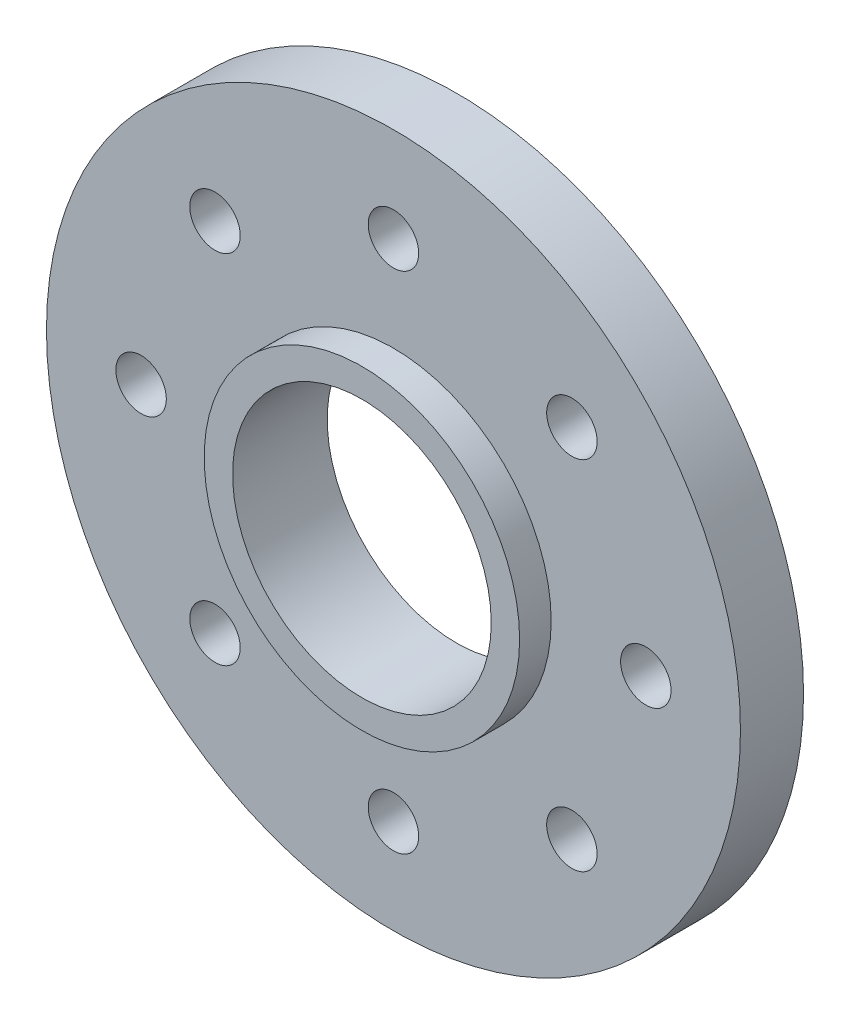
ISO-10303-21;
HEADER;
FILE_DESCRIPTION(('STEP AP214'),'2;1');
FILE_NAME('part.step','',(''),(''),'','','');
FILE_SCHEMA(('AUTOMOTIVE_DESIGN { 1 0 10303 214 1 1 1 1 }'));
ENDSEC;
DATA;
#1=APPLICATION_CONTEXT('core data for automotive mechanical design processes');
#2=APPLICATION_PROTOCOL_DEFINITION('international standard','automotive_design',2000,#1);
#3=PRODUCT_CONTEXT('',#1,'mechanical');
#4=PRODUCT('Part','Part','',(#3));
#5=PRODUCT_RELATED_PRODUCT_CATEGORY('part','',(#4));
#6=PRODUCT_DEFINITION_FORMATION('','',#4);
#7=PRODUCT_DEFINITION_CONTEXT('part definition',#1,'design');
#8=PRODUCT_DEFINITION('design','',#6,#7);
#9=PRODUCT_DEFINITION_SHAPE('','',#8);
#10=(LENGTH_UNIT() NAMED_UNIT(*) SI_UNIT(.MILLI.,.METRE.));
#11=(NAMED_UNIT(*) PLANE_ANGLE_UNIT() SI_UNIT($,.RADIAN.));
#12=(NAMED_UNIT(*) SI_UNIT($,.STERADIAN.) SOLID_ANGLE_UNIT());
#13=UNCERTAINTY_MEASURE_WITH_UNIT(LENGTH_MEASURE(1.E-05),#10,'distance_accuracy_value','');
#14=(GEOMETRIC_REPRESENTATION_CONTEXT(3) GLOBAL_UNCERTAINTY_ASSIGNED_CONTEXT((#13)) GLOBAL_UNIT_ASSIGNED_CONTEXT((#10,
#11,#12)) REPRESENTATION_CONTEXT('',''));
#15=CARTESIAN_POINT('',(0.,0.,0.));
#16=DIRECTION('',(0.,0.,1.));
#17=DIRECTION('',(1.,0.,0.));
#18=AXIS2_PLACEMENT_3D('',#15,#16,#17);
#19=CARTESIAN_POINT('',(0.,0.,2.));
#20=DIRECTION('',(0.,0.,1.));
#21=DIRECTION('',(1.,0.,0.));
#22=AXIS2_PLACEMENT_3D('',#19,#20,#21);
#23=PLANE('',#22);
#24=CARTESIAN_POINT('',(0.,0.,2.));
#25=DIRECTION('',(0.,0.,1.));
#26=DIRECTION('',(1.,0.,0.));
#27=AXIS2_PLACEMENT_3D('',#24,#25,#26);
#28=CIRCLE('',#27,11.);
#29=CARTESIAN_POINT('',(11.,0.,2.));
#30=VERTEX_POINT('',#29);
#31=EDGE_CURVE('E10',#30,#30,#28,.T.);
#32=ORIENTED_EDGE('',*,*,#31,.T.);
#33=EDGE_LOOP('',(#32));
#34=FACE_BOUND('',#33,.T.);
#35=CARTESIAN_POINT('',(-5.65685424949231,5.65685424949245,2.));
#36=DIRECTION('',(0.,0.,1.));
#37=DIRECTION('',(1.,0.,0.));
#38=AXIS2_PLACEMENT_3D('',#35,#36,#37);
#39=CIRCLE('',#38,0.79999999999999);
#40=CARTESIAN_POINT('',(-4.85685424949232,5.65685424949245,2.));
#41=VERTEX_POINT('',#40);
#42=EDGE_CURVE('E75',#41,#41,#39,.T.);
#43=ORIENTED_EDGE('',*,*,#42,.F.);
#44=EDGE_LOOP('',(#43));
#45=FACE_BOUND('',#44,.T.);
#46=CARTESIAN_POINT('',(-7.99999999999989,-1.1350726290868E-13,2.));
#47=DIRECTION('',(0.,0.,1.));
#48=DIRECTION('',(1.,0.,0.));
#49=AXIS2_PLACEMENT_3D('',#46,#47,#48);
#50=CIRCLE('',#49,0.79999999999999);
#51=CARTESIAN_POINT('',(-7.1999999999999,-1.1350726290868E-13,2.));
#52=VERTEX_POINT('',#51);
#53=EDGE_CURVE('E80',#52,#52,#50,.T.);
#54=ORIENTED_EDGE('',*,*,#53,.F.);
#55=EDGE_LOOP('',(#54));
#56=FACE_BOUND('',#55,.T.);
#57=CARTESIAN_POINT('',(-5.65685424949219,-5.65685424949246,2.));
#58=DIRECTION('',(0.,0.,1.));
#59=DIRECTION('',(1.,0.,0.));
#60=AXIS2_PLACEMENT_3D('',#57,#58,#59);
#61=CIRCLE('',#60,0.79999999999999);
#62=CARTESIAN_POINT('',(-4.8568542494922,-5.65685424949246,2.));
#63=VERTEX_POINT('',#62);
#64=EDGE_CURVE('E123',#63,#63,#61,.T.);
#65=ORIENTED_EDGE('',*,*,#64,.F.);
#66=EDGE_LOOP('',(#65));
#67=FACE_BOUND('',#66,.T.);
#68=CARTESIAN_POINT('',(2.25521545591289E-13,-8.,2.));
#69=DIRECTION('',(0.,0.,1.));
#70=DIRECTION('',(1.,0.,0.));
#71=AXIS2_PLACEMENT_3D('',#68,#69,#70);
#72=CIRCLE('',#71,0.79999999999999);
#73=CARTESIAN_POINT('',(0.800000000000215,-8.,2.));
#74=VERTEX_POINT('',#73);
#75=EDGE_CURVE('E116',#74,#74,#72,.T.);
#76=ORIENTED_EDGE('',*,*,#75,.F.);
#77=EDGE_LOOP('',(#76));
#78=FACE_BOUND('',#77,.T.);
#79=CARTESIAN_POINT('',(5.65685424949257,-5.6568542494923,2.));
#80=DIRECTION('',(0.,0.,1.));
#81=DIRECTION('',(1.,0.,0.));
#82=AXIS2_PLACEMENT_3D('',#79,#80,#81);
#83=CIRCLE('',#82,0.79999999999999);
#84=CARTESIAN_POINT('',(6.45685424949256,-5.6568542494923,2.));
#85=VERTEX_POINT('',#84);
#86=EDGE_CURVE('E84',#85,#85,#83,.T.);
#87=ORIENTED_EDGE('',*,*,#86,.F.);
#88=EDGE_LOOP('',(#87));
#89=FACE_BOUND('',#88,.T.);
#90=CARTESIAN_POINT('',(8.,0.,2.));
#91=DIRECTION('',(0.,0.,1.));
#92=DIRECTION('',(1.,0.,0.));
#93=AXIS2_PLACEMENT_3D('',#90,#91,#92);
#94=CIRCLE('',#93,0.79999999999999);
#95=CARTESIAN_POINT('',(8.79999999999999,0.,2.));
#96=VERTEX_POINT('',#95);
#97=EDGE_CURVE('E85',#96,#96,#94,.T.);
#98=ORIENTED_EDGE('',*,*,#97,.F.);
#99=EDGE_LOOP('',(#98));
#100=FACE_BOUND('',#99,.T.);
#101=CARTESIAN_POINT('',(5.65685424949239,5.65685424949237,2.));
#102=DIRECTION('',(0.,0.,1.));
#103=DIRECTION('',(1.,0.,0.));
#104=AXIS2_PLACEMENT_3D('',#101,#102,#103);
#105=CIRCLE('',#104,0.79999999999999);
#106=CARTESIAN_POINT('',(6.45685424949238,5.65685424949237,2.));
#107=VERTEX_POINT('',#106);
#108=EDGE_CURVE('E89',#107,#107,#105,.T.);
#109=ORIENTED_EDGE('',*,*,#108,.F.);
#110=EDGE_LOOP('',(#109));
#111=FACE_BOUND('',#110,.T.);
#112=CARTESIAN_POINT('',(0.,8.,2.));
#113=DIRECTION('',(0.,0.,1.));
#114=DIRECTION('',(1.,0.,0.));
#115=AXIS2_PLACEMENT_3D('',#112,#113,#114);
#116=CIRCLE('',#115,0.79999999999999);
#117=CARTESIAN_POINT('',(0.79999999999999,8.,2.));
#118=VERTEX_POINT('',#117);
#119=EDGE_CURVE('E106',#118,#118,#116,.T.);
#120=ORIENTED_EDGE('',*,*,#119,.F.);
#121=EDGE_LOOP('',(#120));
#122=FACE_BOUND('',#121,.T.);
#123=CARTESIAN_POINT('',(0.,0.,2.));
#124=DIRECTION('',(0.,0.,1.));
#125=DIRECTION('',(1.,0.,0.));
#126=AXIS2_PLACEMENT_3D('',#123,#124,#125);
#127=CIRCLE('',#126,5.);
#128=CARTESIAN_POINT('',(5.,0.,2.));
#129=VERTEX_POINT('',#128);
#130=EDGE_CURVE('E159',#129,#129,#127,.T.);
#131=ORIENTED_EDGE('',*,*,#130,.F.);
#132=EDGE_LOOP('',(#131));
#133=FACE_BOUND('',#132,.T.);
#134=ADVANCED_FACE('F49',(#34,#45,#56,#67,#78,#89,#100,#111,#122,#133),#23,.T.);
#135=CARTESIAN_POINT('',(0.,0.,0.));
#136=DIRECTION('',(0.,0.,1.));
#137=DIRECTION('',(1.,0.,0.));
#138=AXIS2_PLACEMENT_3D('',#135,#136,#137);
#139=PLANE('',#138);
#140=CARTESIAN_POINT('',(0.,8.,0.));
#141=DIRECTION('',(0.,0.,1.));
#142=DIRECTION('',(1.,0.,0.));
#143=AXIS2_PLACEMENT_3D('',#140,#141,#142);
#144=CIRCLE('',#143,0.799999999999989);
#145=CARTESIAN_POINT('',(0.799999999999989,8.,0.));
#146=VERTEX_POINT('',#145);
#147=EDGE_CURVE('E53',#146,#146,#144,.T.);
#148=ORIENTED_EDGE('',*,*,#147,.T.);
#149=EDGE_LOOP('',(#148));
#150=FACE_BOUND('',#149,.T.);
#151=CARTESIAN_POINT('',(5.65685424949239,5.65685424949237,0.));
#152=DIRECTION('',(0.,0.,1.));
#153=DIRECTION('',(1.,0.,0.));
#154=AXIS2_PLACEMENT_3D('',#151,#152,#153);
#155=CIRCLE('',#154,0.799999999999989);
#156=CARTESIAN_POINT('',(6.45685424949238,5.65685424949237,0.));
#157=VERTEX_POINT('',#156);
#158=EDGE_CURVE('E86',#157,#157,#155,.T.);
#159=ORIENTED_EDGE('',*,*,#158,.T.);
#160=EDGE_LOOP('',(#159));
#161=FACE_BOUND('',#160,.T.);
#162=CARTESIAN_POINT('',(8.,0.,0.));
#163=DIRECTION('',(0.,0.,1.));
#164=DIRECTION('',(1.,0.,0.));
#165=AXIS2_PLACEMENT_3D('',#162,#163,#164);
#166=CIRCLE('',#165,0.799999999999989);
#167=CARTESIAN_POINT('',(8.79999999999999,0.,0.));
#168=VERTEX_POINT('',#167);
#169=EDGE_CURVE('E81',#168,#168,#166,.T.);
#170=ORIENTED_EDGE('',*,*,#169,.T.);
#171=EDGE_LOOP('',(#170));
#172=FACE_BOUND('',#171,.T.);
#173=CARTESIAN_POINT('',(5.65685424949257,-5.6568542494923,0.));
#174=DIRECTION('',(0.,0.,1.));
#175=DIRECTION('',(1.,0.,0.));
#176=AXIS2_PLACEMENT_3D('',#173,#174,#175);
#177=CIRCLE('',#176,0.799999999999989);
#178=CARTESIAN_POINT('',(6.45685424949256,-5.6568542494923,0.));
#179=VERTEX_POINT('',#178);
#180=EDGE_CURVE('E112',#179,#179,#177,.T.);
#181=ORIENTED_EDGE('',*,*,#180,.T.);
#182=EDGE_LOOP('',(#181));
#183=FACE_BOUND('',#182,.T.);
#184=CARTESIAN_POINT('',(2.25521545591289E-13,-8.,0.));
#185=DIRECTION('',(0.,0.,1.));
#186=DIRECTION('',(1.,0.,0.));
#187=AXIS2_PLACEMENT_3D('',#184,#185,#186);
#188=CIRCLE('',#187,0.799999999999989);
#189=CARTESIAN_POINT('',(0.800000000000214,-8.,0.));
#190=VERTEX_POINT('',#189);
#191=EDGE_CURVE('E119',#190,#190,#188,.T.);
#192=ORIENTED_EDGE('',*,*,#191,.T.);
#193=EDGE_LOOP('',(#192));
#194=FACE_BOUND('',#193,.T.);
#195=CARTESIAN_POINT('',(-5.65685424949219,-5.65685424949246,0.));
#196=DIRECTION('',(0.,0.,1.));
#197=DIRECTION('',(1.,0.,0.));
#198=AXIS2_PLACEMENT_3D('',#195,#196,#197);
#199=CIRCLE('',#198,0.799999999999989);
#200=CARTESIAN_POINT('',(-4.8568542494922,-5.65685424949246,0.));
#201=VERTEX_POINT('',#200);
#202=EDGE_CURVE('E126',#201,#201,#199,.T.);
#203=ORIENTED_EDGE('',*,*,#202,.T.);
#204=EDGE_LOOP('',(#203));
#205=FACE_BOUND('',#204,.T.);
#206=CARTESIAN_POINT('',(-7.99999999999989,-1.1350726290868E-13,0.));
#207=DIRECTION('',(0.,0.,1.));
#208=DIRECTION('',(1.,0.,0.));
#209=AXIS2_PLACEMENT_3D('',#206,#207,#208);
#210=CIRCLE('',#209,0.799999999999989);
#211=CARTESIAN_POINT('',(-7.1999999999999,-1.1350726290868E-13,0.));
#212=VERTEX_POINT('',#211);
#213=EDGE_CURVE('E76',#212,#212,#210,.T.);
#214=ORIENTED_EDGE('',*,*,#213,.T.);
#215=EDGE_LOOP('',(#214));
#216=FACE_BOUND('',#215,.T.);
#217=CARTESIAN_POINT('',(-5.65685424949231,5.65685424949245,0.));
#218=DIRECTION('',(0.,0.,1.));
#219=DIRECTION('',(1.,0.,0.));
#220=AXIS2_PLACEMENT_3D('',#217,#218,#219);
#221=CIRCLE('',#220,0.799999999999989);
#222=CARTESIAN_POINT('',(-4.85685424949232,5.65685424949245,0.));
#223=VERTEX_POINT('',#222);
#224=EDGE_CURVE('E71',#223,#223,#221,.T.);
#225=ORIENTED_EDGE('',*,*,#224,.T.);
#226=EDGE_LOOP('',(#225));
#227=FACE_BOUND('',#226,.T.);
#228=CARTESIAN_POINT('',(0.,0.,0.));
#229=DIRECTION('',(0.,0.,1.));
#230=DIRECTION('',(1.,0.,0.));
#231=AXIS2_PLACEMENT_3D('',#228,#229,#230);
#232=CIRCLE('',#231,11.);
#233=CARTESIAN_POINT('',(11.,0.,0.));
#234=VERTEX_POINT('',#233);
#235=EDGE_CURVE('E58',#234,#234,#232,.T.);
#236=ORIENTED_EDGE('',*,*,#235,.F.);
#237=EDGE_LOOP('',(#236));
#238=FACE_BOUND('',#237,.T.);
#239=CARTESIAN_POINT('',(0.,0.,0.));
#240=DIRECTION('',(0.,0.,1.));
#241=DIRECTION('',(1.,0.,0.));
#242=AXIS2_PLACEMENT_3D('',#239,#240,#241);
#243=CIRCLE('',#242,4.1);
#244=CARTESIAN_POINT('',(4.1,0.,0.));
#245=VERTEX_POINT('',#244);
#246=EDGE_CURVE('E66',#245,#245,#243,.T.);
#247=ORIENTED_EDGE('',*,*,#246,.T.);
#248=EDGE_LOOP('',(#247));
#249=FACE_BOUND('',#248,.T.);
#250=ADVANCED_FACE('F141',(#150,#161,#172,#183,#194,#205,#216,#227,#238,#249),#139,.F.);
#251=CARTESIAN_POINT('',(0.,0.,2.));
#252=DIRECTION('',(0.,0.,-1.));
#253=DIRECTION('',(-1.,0.,0.));
#254=AXIS2_PLACEMENT_3D('',#251,#252,#253);
#255=CYLINDRICAL_SURFACE('',#254,11.);
#256=ORIENTED_EDGE('',*,*,#31,.F.);
#257=EDGE_LOOP('',(#256));
#258=FACE_BOUND('',#257,.T.);
#259=ORIENTED_EDGE('',*,*,#235,.T.);
#260=EDGE_LOOP('',(#259));
#261=FACE_BOUND('',#260,.T.);
#262=ADVANCED_FACE('F51',(#258,#261),#255,.T.);
#263=CARTESIAN_POINT('',(0.,0.,2.));
#264=DIRECTION('',(0.,0.,-1.));
#265=DIRECTION('',(-1.,0.,0.));
#266=AXIS2_PLACEMENT_3D('',#263,#264,#265);
#267=CYLINDRICAL_SURFACE('',#266,4.1);
#268=ORIENTED_EDGE('',*,*,#246,.F.);
#269=EDGE_LOOP('',(#268));
#270=FACE_BOUND('',#269,.T.);
#271=CARTESIAN_POINT('',(0.,0.,3.));
#272=DIRECTION('',(0.,0.,1.));
#273=DIRECTION('',(1.,0.,0.));
#274=AXIS2_PLACEMENT_3D('',#271,#272,#273);
#275=CIRCLE('',#274,4.1);
#276=CARTESIAN_POINT('',(4.1,0.,3.));
#277=VERTEX_POINT('',#276);
#278=EDGE_CURVE('E162',#277,#277,#275,.T.);
#279=ORIENTED_EDGE('',*,*,#278,.T.);
#280=EDGE_LOOP('',(#279));
#281=FACE_BOUND('',#280,.T.);
#282=ADVANCED_FACE('F170',(#270,#281),#267,.F.);
#283=CARTESIAN_POINT('',(-5.65685424949231,5.65685424949245,2.));
#284=DIRECTION('',(0.,0.,1.));
#285=DIRECTION('',(1.,0.,0.));
#286=AXIS2_PLACEMENT_3D('',#283,#284,#285);
#287=CYLINDRICAL_SURFACE('',#286,0.799999999999989);
#288=ORIENTED_EDGE('',*,*,#42,.T.);
#289=EDGE_LOOP('',(#288));
#290=FACE_BOUND('',#289,.T.);
#291=ORIENTED_EDGE('',*,*,#224,.F.);
#292=EDGE_LOOP('',(#291));
#293=FACE_BOUND('',#292,.T.);
#294=ADVANCED_FACE('F136',(#290,#293),#287,.F.);
#295=CARTESIAN_POINT('',(-7.99999999999989,-1.1350726290868E-13,2.));
#296=DIRECTION('',(0.,0.,1.));
#297=DIRECTION('',(1.,0.,0.));
#298=AXIS2_PLACEMENT_3D('',#295,#296,#297);
#299=CYLINDRICAL_SURFACE('',#298,0.799999999999989);
#300=ORIENTED_EDGE('',*,*,#53,.T.);
#301=EDGE_LOOP('',(#300));
#302=FACE_BOUND('',#301,.T.);
#303=ORIENTED_EDGE('',*,*,#213,.F.);
#304=EDGE_LOOP('',(#303));
#305=FACE_BOUND('',#304,.T.);
#306=ADVANCED_FACE('F205',(#302,#305),#299,.F.);
#307=CARTESIAN_POINT('',(-5.65685424949219,-5.65685424949246,2.));
#308=DIRECTION('',(0.,0.,1.));
#309=DIRECTION('',(1.,0.,0.));
#310=AXIS2_PLACEMENT_3D('',#307,#308,#309);
#311=CYLINDRICAL_SURFACE('',#310,0.799999999999989);
#312=ORIENTED_EDGE('',*,*,#64,.T.);
#313=EDGE_LOOP('',(#312));
#314=FACE_BOUND('',#313,.T.);
#315=ORIENTED_EDGE('',*,*,#202,.F.);
#316=EDGE_LOOP('',(#315));
#317=FACE_BOUND('',#316,.T.);
#318=ADVANCED_FACE('F201',(#314,#317),#311,.F.);
#319=CARTESIAN_POINT('',(2.25521545591289E-13,-8.,2.));
#320=DIRECTION('',(0.,0.,1.));
#321=DIRECTION('',(1.,0.,0.));
#322=AXIS2_PLACEMENT_3D('',#319,#320,#321);
#323=CYLINDRICAL_SURFACE('',#322,0.799999999999989);
#324=ORIENTED_EDGE('',*,*,#75,.T.);
#325=EDGE_LOOP('',(#324));
#326=FACE_BOUND('',#325,.T.);
#327=ORIENTED_EDGE('',*,*,#191,.F.);
#328=EDGE_LOOP('',(#327));
#329=FACE_BOUND('',#328,.T.);
#330=ADVANCED_FACE('F197',(#326,#329),#323,.F.);
#331=CARTESIAN_POINT('',(5.65685424949257,-5.6568542494923,2.));
#332=DIRECTION('',(0.,0.,1.));
#333=DIRECTION('',(1.,0.,0.));
#334=AXIS2_PLACEMENT_3D('',#331,#332,#333);
#335=CYLINDRICAL_SURFACE('',#334,0.799999999999989);
#336=ORIENTED_EDGE('',*,*,#86,.T.);
#337=EDGE_LOOP('',(#336));
#338=FACE_BOUND('',#337,.T.);
#339=ORIENTED_EDGE('',*,*,#180,.F.);
#340=EDGE_LOOP('',(#339));
#341=FACE_BOUND('',#340,.T.);
#342=ADVANCED_FACE('F193',(#338,#341),#335,.F.);
#343=CARTESIAN_POINT('',(8.,0.,2.));
#344=DIRECTION('',(0.,0.,1.));
#345=DIRECTION('',(1.,0.,0.));
#346=AXIS2_PLACEMENT_3D('',#343,#344,#345);
#347=CYLINDRICAL_SURFACE('',#346,0.799999999999989);
#348=ORIENTED_EDGE('',*,*,#97,.T.);
#349=EDGE_LOOP('',(#348));
#350=FACE_BOUND('',#349,.T.);
#351=ORIENTED_EDGE('',*,*,#169,.F.);
#352=EDGE_LOOP('',(#351));
#353=FACE_BOUND('',#352,.T.);
#354=ADVANCED_FACE('F190',(#350,#353),#347,.F.);
#355=CARTESIAN_POINT('',(5.65685424949239,5.65685424949237,2.));
#356=DIRECTION('',(0.,0.,1.));
#357=DIRECTION('',(1.,0.,0.));
#358=AXIS2_PLACEMENT_3D('',#355,#356,#357);
#359=CYLINDRICAL_SURFACE('',#358,0.799999999999989);
#360=ORIENTED_EDGE('',*,*,#108,.T.);
#361=EDGE_LOOP('',(#360));
#362=FACE_BOUND('',#361,.T.);
#363=ORIENTED_EDGE('',*,*,#158,.F.);
#364=EDGE_LOOP('',(#363));
#365=FACE_BOUND('',#364,.T.);
#366=ADVANCED_FACE('F184',(#362,#365),#359,.F.);
#367=CARTESIAN_POINT('',(0.,8.,2.));
#368=DIRECTION('',(0.,0.,1.));
#369=DIRECTION('',(1.,0.,0.));
#370=AXIS2_PLACEMENT_3D('',#367,#368,#369);
#371=CYLINDRICAL_SURFACE('',#370,0.799999999999989);
#372=ORIENTED_EDGE('',*,*,#119,.T.);
#373=EDGE_LOOP('',(#372));
#374=FACE_BOUND('',#373,.T.);
#375=ORIENTED_EDGE('',*,*,#147,.F.);
#376=EDGE_LOOP('',(#375));
#377=FACE_BOUND('',#376,.T.);
#378=ADVANCED_FACE('F175',(#374,#377),#371,.F.);
#379=CARTESIAN_POINT('',(0.,0.,3.));
#380=DIRECTION('',(0.,0.,1.));
#381=DIRECTION('',(1.,0.,0.));
#382=AXIS2_PLACEMENT_3D('',#379,#380,#381);
#383=PLANE('',#382);
#384=CARTESIAN_POINT('',(0.,0.,3.));
#385=DIRECTION('',(0.,0.,1.));
#386=DIRECTION('',(1.,0.,0.));
#387=AXIS2_PLACEMENT_3D('',#384,#385,#386);
#388=CIRCLE('',#387,5.);
#389=CARTESIAN_POINT('',(5.,0.,3.));
#390=VERTEX_POINT('',#389);
#391=EDGE_CURVE('E161',#390,#390,#388,.T.);
#392=ORIENTED_EDGE('',*,*,#391,.T.);
#393=EDGE_LOOP('',(#392));
#394=FACE_BOUND('',#393,.T.);
#395=ORIENTED_EDGE('',*,*,#278,.F.);
#396=EDGE_LOOP('',(#395));
#397=FACE_BOUND('',#396,.T.);
#398=ADVANCED_FACE('F172',(#394,#397),#383,.T.);
#399=CARTESIAN_POINT('',(0.,0.,3.));
#400=DIRECTION('',(0.,0.,-1.));
#401=DIRECTION('',(-1.,0.,0.));
#402=AXIS2_PLACEMENT_3D('',#399,#400,#401);
#403=CYLINDRICAL_SURFACE('',#402,5.);
#404=ORIENTED_EDGE('',*,*,#391,.F.);
#405=EDGE_LOOP('',(#404));
#406=FACE_BOUND('',#405,.T.);
#407=ORIENTED_EDGE('',*,*,#130,.T.);
#408=EDGE_LOOP('',(#407));
#409=FACE_BOUND('',#408,.T.);
#410=ADVANCED_FACE('F174',(#406,#409),#403,.T.);
#411=CLOSED_SHELL('',(#134,#250,#262,#282,#294,#306,#318,#330,#342,#354,#366,#378,#398,#410));
#412=MANIFOLD_SOLID_BREP('B2',#411);
#413=ADVANCED_BREP_SHAPE_REPRESENTATION('',(#18,#412),#14);
#414=SHAPE_DEFINITION_REPRESENTATION(#9,#413);
ENDSEC;
END-ISO-10303-21;
